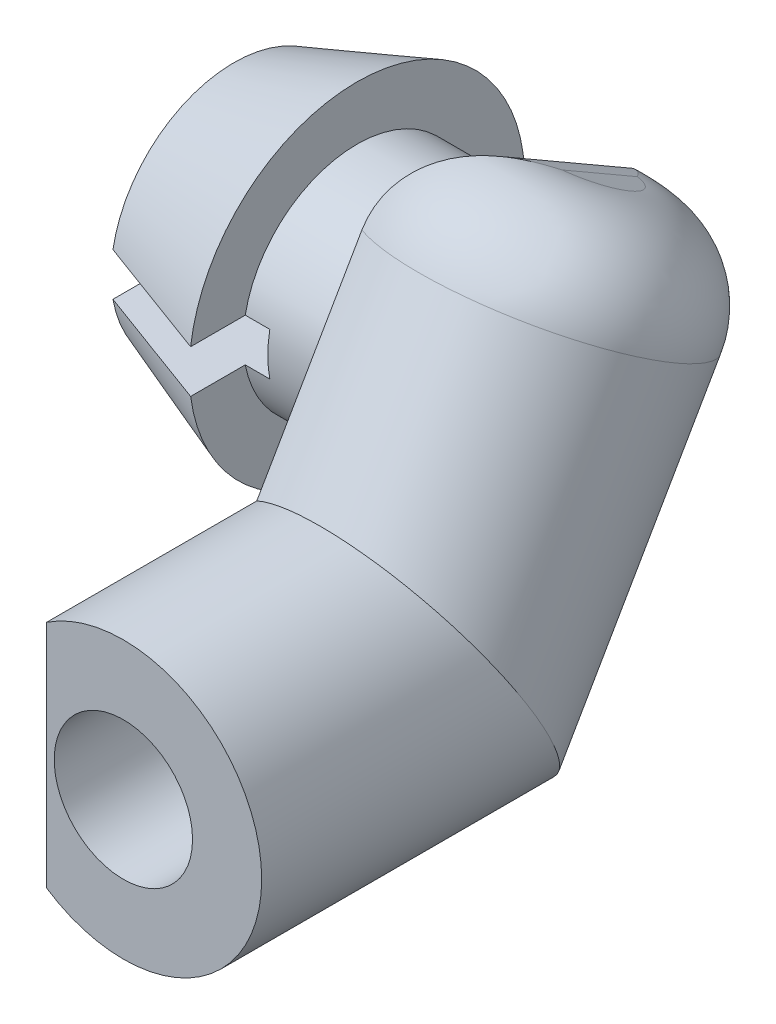
ISO-10303-21;
HEADER;
FILE_DESCRIPTION(('STEP AP214'),'2;1');
FILE_NAME('part.step','',(''),(''),'','','');
FILE_SCHEMA(('AUTOMOTIVE_DESIGN { 1 0 10303 214 1 1 1 1 }'));
ENDSEC;
DATA;
#1=APPLICATION_CONTEXT('core data for automotive mechanical design processes');
#2=APPLICATION_PROTOCOL_DEFINITION('international standard','automotive_design',2000,#1);
#3=PRODUCT_CONTEXT('',#1,'mechanical');
#4=PRODUCT('Part','Part','',(#3));
#5=PRODUCT_RELATED_PRODUCT_CATEGORY('part','',(#4));
#6=PRODUCT_DEFINITION_FORMATION('','',#4);
#7=PRODUCT_DEFINITION_CONTEXT('part definition',#1,'design');
#8=PRODUCT_DEFINITION('design','',#6,#7);
#9=PRODUCT_DEFINITION_SHAPE('','',#8);
#10=(LENGTH_UNIT() NAMED_UNIT(*) SI_UNIT(.MILLI.,.METRE.));
#11=(NAMED_UNIT(*) PLANE_ANGLE_UNIT() SI_UNIT($,.RADIAN.));
#12=(NAMED_UNIT(*) SI_UNIT($,.STERADIAN.) SOLID_ANGLE_UNIT());
#13=UNCERTAINTY_MEASURE_WITH_UNIT(LENGTH_MEASURE(1.E-05),#10,'distance_accuracy_value','');
#14=(GEOMETRIC_REPRESENTATION_CONTEXT(3) GLOBAL_UNCERTAINTY_ASSIGNED_CONTEXT((#13)) GLOBAL_UNIT_ASSIGNED_CONTEXT((#10,
#11,#12)) REPRESENTATION_CONTEXT('',''));
#15=CARTESIAN_POINT('',(0.,0.,0.));
#16=DIRECTION('',(0.,0.,1.));
#17=DIRECTION('',(1.,0.,0.));
#18=AXIS2_PLACEMENT_3D('',#15,#16,#17);
#19=CARTESIAN_POINT('',(-2.45,3.03150325993902,-6.24928233047493));
#20=DIRECTION('',(1.,0.,0.));
#21=DIRECTION('',(0.,0.,-1.));
#22=AXIS2_PLACEMENT_3D('',#19,#20,#21);
#23=CYLINDRICAL_SURFACE('',#22,1.85);
#24=CARTESIAN_POINT('',(-1.25,3.03150325993902,-6.24928233047493));
#25=DIRECTION('',(1.,0.,0.));
#26=DIRECTION('',(0.,0.,-1.));
#27=AXIS2_PLACEMENT_3D('',#24,#25,#26);
#28=CIRCLE('',#27,1.85);
#29=CARTESIAN_POINT('',(-1.25,3.1193095429098,-8.09719738714579));
#30=VERTEX_POINT('',#29);
#31=CARTESIAN_POINT('',(-1.25,4.67574778453712,-5.40136727380407));
#32=VERTEX_POINT('',#31);
#33=EDGE_CURVE('E178',#30,#32,#28,.F.);
#34=ORIENTED_EDGE('',*,*,#33,.T.);
#35=CARTESIAN_POINT('',(-1.25,4.67574778453712,-5.40136727380407));
#36=CARTESIAN_POINT('',(-1.25000121979341,4.69741105624072,-5.44336328630028));
#37=CARTESIAN_POINT('',(-1.24841961478353,4.71743096333026,-5.48614866521578));
#38=CARTESIAN_POINT('',(-1.24258977067846,4.75406605077159,-5.57290476960205));
#39=CARTESIAN_POINT('',(-1.23834561930391,4.77068639858206,-5.61687357933179));
#40=CARTESIAN_POINT('',(-1.22244273194947,4.81512468008795,-5.74945080757565));
#41=CARTESIAN_POINT('',(-1.20759742293953,4.83786936065223,-5.83941362848114));
#42=CARTESIAN_POINT('',(-1.17336029017098,4.86955794135819,-6.02024792146274));
#43=CARTESIAN_POINT('',(-1.15399301659849,4.87857445239295,-6.11111203611594));
#44=CARTESIAN_POINT('',(-1.11427709602543,4.88323244260568,-6.29324049690353));
#45=CARTESIAN_POINT('',(-1.09392549436535,4.87883083211679,-6.38450519064851));
#46=CARTESIAN_POINT('',(-1.05300766425374,4.85467067879845,-6.58060963875227));
#47=CARTESIAN_POINT('',(-1.03292448799233,4.83257571640876,-6.68529396859944));
#48=CARTESIAN_POINT('',(-1.00991330576057,4.78581326895761,-6.83899951034959));
#49=CARTESIAN_POINT('',(-1.00343104098379,4.76797701066329,-6.88963897413855));
#50=CARTESIAN_POINT('',(-0.993349655175071,4.72784366705155,-6.98942811725313));
#51=CARTESIAN_POINT('',(-0.9897498028627,4.7055477149728,-7.03857817140181));
#52=CARTESIAN_POINT('',(-0.98600016415372,4.65948869985272,-7.12930876643157));
#53=CARTESIAN_POINT('',(-0.985501666041698,4.63618811819955,-7.17111041400118));
#54=CARTESIAN_POINT('',(-0.987051878414754,4.58644119589734,-7.2527552107333));
#55=CARTESIAN_POINT('',(-0.989101454927161,4.55999378848356,-7.29259768923744));
#56=CARTESIAN_POINT('',(-0.998900113700351,4.47626778757583,-7.40869331291401));
#57=CARTESIAN_POINT('',(-1.01029801577574,4.41459014636724,-7.48154459982543));
#58=CARTESIAN_POINT('',(-1.03871039863275,4.28688056062028,-7.61096561180715));
#59=CARTESIAN_POINT('',(-1.05522477346423,4.22154968043957,-7.66835711703519));
#60=CARTESIAN_POINT('',(-1.09089104291814,4.08390354647642,-7.77323876354404));
#61=CARTESIAN_POINT('',(-1.1100465802427,4.01157868844169,-7.82071499821039));
#62=CARTESIAN_POINT('',(-1.15145751959943,3.84643662751125,-7.91331300289418));
#63=CARTESIAN_POINT('',(-1.17360251230077,3.75235010978907,-7.95623529209763));
#64=CARTESIAN_POINT('',(-1.21172750019582,3.55737384347678,-8.02596197640884));
#65=CARTESIAN_POINT('',(-1.22772940474008,3.45650980881703,-8.05282384587123));
#66=CARTESIAN_POINT('',(-1.24176803046921,3.31503848880074,-8.07784795722367));
#67=CARTESIAN_POINT('',(-1.24478270851941,3.27615582464556,-8.08345565350654));
#68=CARTESIAN_POINT('',(-1.24889945449133,3.19798315269313,-8.09219618368726));
#69=CARTESIAN_POINT('',(-1.24999996237084,3.15869283886994,-8.09532699780284));
#70=CARTESIAN_POINT('',(-1.25,3.1193095429098,-8.09719738714579));
#71=B_SPLINE_CURVE_WITH_KNOTS('',3,(#35,#36,#37,#38,#39,#40,#41,#42,#43,#44,#45,#46,#47,#48,#49,
#50,#51,#52,#53,#54,#55,#56,#57,#58,#59,#60,#61,#62,#63,#64,#65,#66,#67,#68,#69,#70),
.UNSPECIFIED.,.F.,.F.,(4,2,2,2,2,2,2,2,2,2,2,2,2,2,2,2,2,4),(0.,0.141616962720466,
0.283017035833864,0.563547721889874,0.842589409430656,1.12252812756175,1.44709634485264,
1.6091013976754,1.77106533608546,1.91443045887446,2.05784432123449,2.34457271448195,
2.60922102894377,2.87423806819121,3.19010308915769,3.50483087199597,3.62292517315778,
3.74111567575703),.UNSPECIFIED.);
#72=EDGE_CURVE('E11',#32,#30,#71,.T.);
#73=ORIENTED_EDGE('',*,*,#72,.T.);
#74=EDGE_LOOP('',(#34,#73));
#75=FACE_BOUND('',#74,.T.);
#76=DIRECTION('',(1.,0.,0.));
#77=VECTOR('',#76,1.);
#78=CARTESIAN_POINT('',(-2.45,2.68150325993902,-4.43269211801644));
#79=LINE('',#78,#77);
#80=CARTESIAN_POINT('',(-2.45,2.68150325993902,-4.43269211801644));
#81=VERTEX_POINT('',#80);
#82=CARTESIAN_POINT('',(-2.05,2.68150325993902,-4.43269211801644));
#83=VERTEX_POINT('',#82);
#84=EDGE_CURVE('E160',#81,#83,#79,.T.);
#85=ORIENTED_EDGE('',*,*,#84,.F.);
#86=CARTESIAN_POINT('',(-2.45,3.03150325993902,-6.24928233047493));
#87=DIRECTION('',(-1.,0.,0.));
#88=DIRECTION('',(0.,0.,1.));
#89=AXIS2_PLACEMENT_3D('',#86,#87,#88);
#90=CIRCLE('',#89,1.85);
#91=CARTESIAN_POINT('',(-2.45,3.38150325993902,-4.43269211801644));
#92=VERTEX_POINT('',#91);
#93=EDGE_CURVE('E165',#92,#81,#90,.T.);
#94=ORIENTED_EDGE('',*,*,#93,.F.);
#95=DIRECTION('',(1.,0.,0.));
#96=VECTOR('',#95,1.);
#97=CARTESIAN_POINT('',(-2.45,3.38150325993902,-4.43269211801644));
#98=LINE('',#97,#96);
#99=CARTESIAN_POINT('',(-2.05,3.38150325993902,-4.43269211801644));
#100=VERTEX_POINT('',#99);
#101=EDGE_CURVE('E308',#92,#100,#98,.T.);
#102=ORIENTED_EDGE('',*,*,#101,.T.);
#103=CARTESIAN_POINT('',(-2.05,3.03150325993902,-6.24928233047493));
#104=DIRECTION('',(-1.,0.,0.));
#105=DIRECTION('',(0.,0.,1.));
#106=AXIS2_PLACEMENT_3D('',#103,#104,#105);
#107=CIRCLE('',#106,1.85);
#108=EDGE_CURVE('E156',#83,#100,#107,.T.);
#109=ORIENTED_EDGE('',*,*,#108,.F.);
#110=EDGE_LOOP('',(#85,#94,#102,#109));
#111=FACE_BOUND('',#110,.T.);
#112=ADVANCED_FACE('F42',(#75,#111),#23,.T.);
#113=CARTESIAN_POINT('',(-4.45,3.03150325993902,-6.24928233047493));
#114=DIRECTION('',(1.,0.,0.));
#115=DIRECTION('',(0.,0.,1.));
#116=AXIS2_PLACEMENT_3D('',#113,#114,#115);
#117=CONICAL_SURFACE('',#116,2.,0.349065850398867);
#118=CARTESIAN_POINT('',(-7.24583087660519,2.68150325993902,-5.33134371909587));
#119=CARTESIAN_POINT('',(-7.13213382111476,2.68150325993902,-5.28707279867282));
#120=CARTESIAN_POINT('',(-7.01831275225143,2.68150325993902,-5.24312277983278));
#121=CARTESIAN_POINT('',(-6.79048592817877,2.68150325993902,-5.15570642590608));
#122=CARTESIAN_POINT('',(-6.67648017443273,2.68150325993902,-5.11224008700838));
#123=CARTESIAN_POINT('',(-6.33428168304235,2.68150325993902,-4.98232969868854));
#124=CARTESIAN_POINT('',(-6.10590424158329,2.68150325993902,-4.89637293623471));
#125=CARTESIAN_POINT('',(-5.64888458324298,2.68150325993902,-4.72518345294186));
#126=CARTESIAN_POINT('',(-5.42024237230883,2.68150325993902,-4.63995071618539));
#127=CARTESIAN_POINT('',(-4.96278965405802,2.68150325993902,-4.46993782990602));
#128=CARTESIAN_POINT('',(-4.73397914663228,2.68150325993902,-4.38515768067675));
#129=CARTESIAN_POINT('',(-4.04738516769673,2.68150325993902,-4.13125414104574));
#130=CARTESIAN_POINT('',(-3.58944011124171,2.68150325993902,-3.96256798358803));
#131=CARTESIAN_POINT('',(-2.67333013669729,2.68150325993902,-3.62576842690405));
#132=CARTESIAN_POINT('',(-2.21516521470735,2.68150325993902,-3.4576550383025));
#133=CARTESIAN_POINT('',(-1.29871133958246,2.68150325993902,-3.12176843409857));
#134=CARTESIAN_POINT('',(-0.840422386601865,2.68150325993902,-2.953995218075));
#135=CARTESIAN_POINT('',(-0.260778479802734,2.68150325993902,-2.74194782573838));
#136=CARTESIAN_POINT('',(-0.139459610081791,2.68150325993902,-2.69757495618113));
#137=CARTESIAN_POINT('',(0.103182379147166,2.68150325993902,-2.60884309322604));
#138=CARTESIAN_POINT('',(0.224505498625339,2.68150325993902,-2.5644840997466));
#139=CARTESIAN_POINT('',(0.345830876605189,2.68150325993902,-2.52013128072791));
#140=B_SPLINE_CURVE_WITH_KNOTS('',3,(#118,#119,#120,#121,#122,#123,#124,#125,#126,#127,#128,
#129,#130,#131,#132,#133,#134,#135,#136,#137,#138,#139),.UNSPECIFIED.,.F.,.F.,(4,2,2,2,2,2,2,2,
2,2,4),(0.,0.366034339768444,0.732065793405982,1.46411752990219,2.19615313063416,
2.9281892062517,4.39226414833949,5.85636610240713,7.32046624255301,7.70800330885212,
8.09553805177353),.UNSPECIFIED.);
#141=CARTESIAN_POINT('',(-4.45,2.68150325993902,-4.28014546372341));
#142=VERTEX_POINT('',#141);
#143=CARTESIAN_POINT('',(-2.45,2.68150325993902,-3.54388786758106));
#144=VERTEX_POINT('',#143);
#145=EDGE_CURVE('E276',#142,#144,#140,.T.);
#146=ORIENTED_EDGE('',*,*,#145,.F.);
#147=CARTESIAN_POINT('',(-4.45,3.03150325993902,-6.24928233047493));
#148=DIRECTION('',(-1.,0.,0.));
#149=DIRECTION('',(0.,0.,1.));
#150=AXIS2_PLACEMENT_3D('',#147,#148,#149);
#151=CIRCLE('',#150,2.);
#152=CARTESIAN_POINT('',(-4.45,3.38150325993902,-4.28014546372341));
#153=VERTEX_POINT('',#152);
#154=EDGE_CURVE('E163',#153,#142,#151,.T.);
#155=ORIENTED_EDGE('',*,*,#154,.F.);
#156=CARTESIAN_POINT('',(-7.24583087660519,3.38150325993902,-5.33134371909587));
#157=CARTESIAN_POINT('',(-7.13213382111476,3.38150325993902,-5.28707279867282));
#158=CARTESIAN_POINT('',(-7.01831275225143,3.38150325993902,-5.24312277983278));
#159=CARTESIAN_POINT('',(-6.79048592817877,3.38150325993902,-5.15570642590608));
#160=CARTESIAN_POINT('',(-6.67648017443273,3.38150325993902,-5.11224008700838));
#161=CARTESIAN_POINT('',(-6.33428168304235,3.38150325993902,-4.98232969868854));
#162=CARTESIAN_POINT('',(-6.10590424158329,3.38150325993902,-4.89637293623471));
#163=CARTESIAN_POINT('',(-5.64888458324298,3.38150325993902,-4.72518345294186));
#164=CARTESIAN_POINT('',(-5.42024237230883,3.38150325993902,-4.63995071618539));
#165=CARTESIAN_POINT('',(-4.96278965405802,3.38150325993902,-4.46993782990602));
#166=CARTESIAN_POINT('',(-4.73397914663228,3.38150325993902,-4.38515768067675));
#167=CARTESIAN_POINT('',(-4.04738516769673,3.38150325993902,-4.13125414104574));
#168=CARTESIAN_POINT('',(-3.58944011124171,3.38150325993902,-3.96256798358803));
#169=CARTESIAN_POINT('',(-2.67333013669729,3.38150325993902,-3.62576842690405));
#170=CARTESIAN_POINT('',(-2.21516521470735,3.38150325993902,-3.4576550383025));
#171=CARTESIAN_POINT('',(-1.29871133958246,3.38150325993902,-3.12176843409857));
#172=CARTESIAN_POINT('',(-0.840422386601865,3.38150325993902,-2.953995218075));
#173=CARTESIAN_POINT('',(-0.260778479802735,3.38150325993902,-2.74194782573838));
#174=CARTESIAN_POINT('',(-0.139459610081791,3.38150325993902,-2.69757495618113));
#175=CARTESIAN_POINT('',(0.103182379147165,3.38150325993902,-2.60884309322604));
#176=CARTESIAN_POINT('',(0.224505498625339,3.38150325993902,-2.5644840997466));
#177=CARTESIAN_POINT('',(0.345830876605189,3.38150325993902,-2.52013128072791));
#178=B_SPLINE_CURVE_WITH_KNOTS('',3,(#156,#157,#158,#159,#160,#161,#162,#163,#164,#165,#166,
#167,#168,#169,#170,#171,#172,#173,#174,#175,#176,#177),.UNSPECIFIED.,.F.,.F.,(4,2,2,2,2,2,2,2,
2,2,4),(0.,0.366034339768444,0.732065793405982,1.46411752990219,2.19615313063416,
2.9281892062517,4.39226414833949,5.85636610240713,7.32046624255301,7.70800330885212,
8.09553805177353),.UNSPECIFIED.);
#179=CARTESIAN_POINT('',(-2.45,3.38150325993902,-3.54388786758106));
#180=VERTEX_POINT('',#179);
#181=EDGE_CURVE('E137',#153,#180,#178,.T.);
#182=ORIENTED_EDGE('',*,*,#181,.T.);
#183=CARTESIAN_POINT('',(-2.45,3.03150325993902,-6.24928233047493));
#184=DIRECTION('',(-1.,0.,0.));
#185=DIRECTION('',(0.,0.,1.));
#186=AXIS2_PLACEMENT_3D('',#183,#184,#185);
#187=CIRCLE('',#186,2.72794046853241);
#188=EDGE_CURVE('E158',#180,#144,#187,.T.);
#189=ORIENTED_EDGE('',*,*,#188,.T.);
#190=EDGE_LOOP('',(#146,#155,#182,#189));
#191=FACE_BOUND('',#190,.T.);
#192=ADVANCED_FACE('F225',(#191),#117,.T.);
#193=CARTESIAN_POINT('',(-4.45,3.03150325993902,-6.24928233047493));
#194=DIRECTION('',(-1.,0.,0.));
#195=DIRECTION('',(0.,0.,1.));
#196=AXIS2_PLACEMENT_3D('',#193,#194,#195);
#197=PLANE('',#196);
#198=ORIENTED_EDGE('',*,*,#154,.T.);
#199=DIRECTION('',(0.,0.,1.));
#200=VECTOR('',#199,1.);
#201=CARTESIAN_POINT('',(-4.45,2.68150325993902,-5.47468566123345));
#202=LINE('',#201,#200);
#203=CARTESIAN_POINT('',(-4.45,2.68150325993902,-5.47468566123345));
#204=VERTEX_POINT('',#203);
#205=EDGE_CURVE('E142',#204,#142,#202,.T.);
#206=ORIENTED_EDGE('',*,*,#205,.F.);
#207=CARTESIAN_POINT('',(-4.45,3.03150325993902,-6.24928233047493));
#208=DIRECTION('',(-1.,0.,0.));
#209=DIRECTION('',(0.,0.,1.));
#210=AXIS2_PLACEMENT_3D('',#207,#208,#209);
#211=CIRCLE('',#210,0.85);
#212=CARTESIAN_POINT('',(-4.45,3.38150325993902,-5.47468566123345));
#213=VERTEX_POINT('',#212);
#214=EDGE_CURVE('E149',#213,#204,#211,.T.);
#215=ORIENTED_EDGE('',*,*,#214,.F.);
#216=DIRECTION('',(0.,0.,1.));
#217=VECTOR('',#216,1.);
#218=CARTESIAN_POINT('',(-4.45,3.38150325993902,-5.47468566123345));
#219=LINE('',#218,#217);
#220=EDGE_CURVE('E130',#213,#153,#219,.T.);
#221=ORIENTED_EDGE('',*,*,#220,.T.);
#222=EDGE_LOOP('',(#198,#206,#215,#221));
#223=FACE_BOUND('',#222,.T.);
#224=ADVANCED_FACE('F155',(#223),#197,.T.);
#225=CARTESIAN_POINT('',(-2.45,3.03150325993902,-6.24928233047493));
#226=DIRECTION('',(-1.,0.,0.));
#227=DIRECTION('',(0.,0.,1.));
#228=AXIS2_PLACEMENT_3D('',#225,#226,#227);
#229=PLANE('',#228);
#230=DIRECTION('',(0.,0.,-1.));
#231=VECTOR('',#230,1.);
#232=CARTESIAN_POINT('',(-2.45,2.68150325993902,-6.24928233047493));
#233=LINE('',#232,#231);
#234=EDGE_CURVE('E284',#144,#81,#233,.T.);
#235=ORIENTED_EDGE('',*,*,#234,.F.);
#236=ORIENTED_EDGE('',*,*,#188,.F.);
#237=DIRECTION('',(0.,0.,-1.));
#238=VECTOR('',#237,1.);
#239=CARTESIAN_POINT('',(-2.45,3.38150325993902,-6.24928233047493));
#240=LINE('',#239,#238);
#241=EDGE_CURVE('E152',#180,#92,#240,.T.);
#242=ORIENTED_EDGE('',*,*,#241,.T.);
#243=ORIENTED_EDGE('',*,*,#93,.T.);
#244=EDGE_LOOP('',(#235,#236,#242,#243));
#245=FACE_BOUND('',#244,.T.);
#246=ADVANCED_FACE('F227',(#245),#229,.F.);
#247=CARTESIAN_POINT('',(-2.05,3.03150325993902,-6.24928233047493));
#248=DIRECTION('',(-1.,0.,0.));
#249=DIRECTION('',(0.,0.,1.));
#250=AXIS2_PLACEMENT_3D('',#247,#248,#249);
#251=CYLINDRICAL_SURFACE('',#250,0.85);
#252=DIRECTION('',(-1.,0.,0.));
#253=VECTOR('',#252,1.);
#254=CARTESIAN_POINT('',(-2.05,2.68150325993902,-5.47468566123345));
#255=LINE('',#254,#253);
#256=CARTESIAN_POINT('',(-2.05,2.68150325993902,-5.47468566123345));
#257=VERTEX_POINT('',#256);
#258=EDGE_CURVE('E316',#257,#204,#255,.T.);
#259=ORIENTED_EDGE('',*,*,#258,.F.);
#260=CARTESIAN_POINT('',(-2.05,3.03150325993902,-6.24928233047493));
#261=DIRECTION('',(-1.,0.,0.));
#262=DIRECTION('',(0.,0.,1.));
#263=AXIS2_PLACEMENT_3D('',#260,#261,#262);
#264=CIRCLE('',#263,0.85);
#265=CARTESIAN_POINT('',(-2.05,3.38150325993902,-5.47468566123345));
#266=VERTEX_POINT('',#265);
#267=EDGE_CURVE('E151',#266,#257,#264,.T.);
#268=ORIENTED_EDGE('',*,*,#267,.F.);
#269=DIRECTION('',(-1.,0.,0.));
#270=VECTOR('',#269,1.);
#271=CARTESIAN_POINT('',(-2.05,3.38150325993902,-5.47468566123345));
#272=LINE('',#271,#270);
#273=EDGE_CURVE('E134',#266,#213,#272,.T.);
#274=ORIENTED_EDGE('',*,*,#273,.T.);
#275=ORIENTED_EDGE('',*,*,#214,.T.);
#276=EDGE_LOOP('',(#259,#268,#274,#275));
#277=FACE_BOUND('',#276,.T.);
#278=ADVANCED_FACE('F148',(#277),#251,.F.);
#279=CARTESIAN_POINT('',(0.,5.19615242270664,-7.49999999999999));
#280=DIRECTION('',(0.,-0.86602540378444,0.499999999999998));
#281=DIRECTION('',(1.,0.,0.));
#282=AXIS2_PLACEMENT_3D('',#279,#280,#281);
#283=PLANE('',#282);
#284=CARTESIAN_POINT('',(0.,5.19615242270664,-7.49999999999998));
#285=DIRECTION('',(0.,-0.86602540378444,0.499999999999998));
#286=DIRECTION('',(0.,-0.499999999999998,-0.86602540378444));
#287=AXIS2_PLACEMENT_3D('',#284,#285,#286);
#288=CIRCLE('',#287,0.75);
#289=CARTESIAN_POINT('',(0.25,5.54970581329991,-6.88762756430419));
#290=VERTEX_POINT('',#289);
#291=CARTESIAN_POINT('',(0.25,4.84259903211337,-8.11237243569578));
#292=VERTEX_POINT('',#291);
#293=EDGE_CURVE('E63',#290,#292,#288,.F.);
#294=ORIENTED_EDGE('',*,*,#293,.T.);
#295=DIRECTION('',(0.,-0.499999999999998,-0.86602540378444));
#296=VECTOR('',#295,1.);
#297=CARTESIAN_POINT('',(0.25,5.19615242270664,-7.49999999999999));
#298=LINE('',#297,#296);
#299=EDGE_CURVE('E209',#292,#290,#298,.F.);
#300=ORIENTED_EDGE('',*,*,#299,.T.);
#301=EDGE_LOOP('',(#294,#300));
#302=FACE_BOUND('',#301,.T.);
#303=ADVANCED_FACE('F239',(#302),#283,.F.);
#304=CARTESIAN_POINT('',(0.,0.,0.));
#305=DIRECTION('',(0.,0.,1.));
#306=DIRECTION('',(1.,0.,0.));
#307=AXIS2_PLACEMENT_3D('',#304,#305,#306);
#308=PLANE('',#307);
#309=CARTESIAN_POINT('',(0.,0.,0.));
#310=DIRECTION('',(0.,0.,1.));
#311=DIRECTION('',(1.,0.,0.));
#312=AXIS2_PLACEMENT_3D('',#309,#310,#311);
#313=CIRCLE('',#312,1.125);
#314=CARTESIAN_POINT('',(1.125,0.,0.));
#315=VERTEX_POINT('',#314);
#316=EDGE_CURVE('E168',#315,#315,#313,.T.);
#317=ORIENTED_EDGE('',*,*,#316,.F.);
#318=EDGE_LOOP('',(#317));
#319=FACE_BOUND('',#318,.T.);
#320=CARTESIAN_POINT('',(0.,0.,0.));
#321=DIRECTION('',(0.,0.,1.));
#322=DIRECTION('',(1.,0.,0.));
#323=AXIS2_PLACEMENT_3D('',#320,#321,#322);
#324=CIRCLE('',#323,2.25);
#325=CARTESIAN_POINT('',(-1.25,-1.87082869338697,0.));
#326=VERTEX_POINT('',#325);
#327=CARTESIAN_POINT('',(-1.25,1.87082869338697,0.));
#328=VERTEX_POINT('',#327);
#329=EDGE_CURVE('E180',#326,#328,#324,.T.);
#330=ORIENTED_EDGE('',*,*,#329,.T.);
#331=DIRECTION('',(0.,-1.,0.));
#332=VECTOR('',#331,1.);
#333=CARTESIAN_POINT('',(-1.25,1.87082869338697,0.));
#334=LINE('',#333,#332);
#335=EDGE_CURVE('E183',#328,#326,#334,.T.);
#336=ORIENTED_EDGE('',*,*,#335,.T.);
#337=EDGE_LOOP('',(#330,#336));
#338=FACE_BOUND('',#337,.T.);
#339=ADVANCED_FACE('F251',(#319,#338),#308,.T.);
#340=CARTESIAN_POINT('',(0.,-1.73972466625438,-3.49556949562221));
#341=DIRECTION('',(0.,0.86602540378444,-0.499999999999998));
#342=DIRECTION('',(0.,0.499999999999998,0.86602540378444));
#343=AXIS2_PLACEMENT_3D('',#340,#341,#342);
#344=CYLINDRICAL_SURFACE('',#343,2.25);
#345=DIRECTION('',(0.,0.86602540378444,-0.499999999999998));
#346=VECTOR('',#345,1.);
#347=CARTESIAN_POINT('',(-1.25,-2.67513901294786,-5.11575467022417));
#348=LINE('',#347,#346);
#349=CARTESIAN_POINT('',(-1.25,-1.87082869338697,-5.58012344973465));
#350=VERTEX_POINT('',#349);
#351=CARTESIAN_POINT('',(-1.25,2.9616999703365,-8.37018517460196));
#352=VERTEX_POINT('',#351);
#353=EDGE_CURVE('E184',#350,#352,#348,.T.);
#354=ORIENTED_EDGE('',*,*,#353,.T.);
#355=CARTESIAN_POINT('',(0.,3.89711431702998,-6.74999999999999));
#356=DIRECTION('',(0.,-0.86602540378444,0.499999999999998));
#357=DIRECTION('',(0.,-0.499999999999998,-0.86602540378444));
#358=AXIS2_PLACEMENT_3D('',#355,#356,#357);
#359=CIRCLE('',#358,2.25);
#360=CARTESIAN_POINT('',(-1.25,4.83252866372346,-5.12981482539802));
#361=VERTEX_POINT('',#360);
#362=EDGE_CURVE('E56',#352,#361,#359,.T.);
#363=ORIENTED_EDGE('',*,*,#362,.T.);
#364=DIRECTION('',(0.,0.86602540378444,-0.499999999999998));
#365=VECTOR('',#364,1.);
#366=CARTESIAN_POINT('',(-1.25,-0.804310319560902,-1.87538432102024));
#367=LINE('',#366,#365);
#368=CARTESIAN_POINT('',(-1.25,1.87082869338697,-3.41987655026535));
#369=VERTEX_POINT('',#368);
#370=EDGE_CURVE('E172',#369,#361,#367,.T.);
#371=ORIENTED_EDGE('',*,*,#370,.F.);
#372=CARTESIAN_POINT('',(0.,0.,-4.5));
#373=DIRECTION('',(0.,0.500000000000001,-0.866025403784438));
#374=DIRECTION('',(0.,-0.866025403784438,-0.500000000000001));
#375=AXIS2_PLACEMENT_3D('',#372,#373,#374);
#376=ELLIPSE('',#375,2.59807621135332,2.25);
#377=EDGE_CURVE('E179',#369,#350,#376,.T.);
#378=ORIENTED_EDGE('',*,*,#377,.T.);
#379=EDGE_LOOP('',(#354,#363,#371,#378));
#380=FACE_BOUND('',#379,.T.);
#381=ADVANCED_FACE('F248',(#380),#344,.T.);
#382=CARTESIAN_POINT('',(-1.25,-0.804310319560902,-1.87538432102024));
#383=DIRECTION('',(1.,0.,0.));
#384=DIRECTION('',(0.,0.,-1.));
#385=AXIS2_PLACEMENT_3D('',#382,#383,#384);
#386=PLANE('',#385);
#387=ORIENTED_EDGE('',*,*,#370,.T.);
#388=DIRECTION('',(0.,-0.499999999999998,-0.86602540378444));
#389=VECTOR('',#388,1.);
#390=CARTESIAN_POINT('',(-1.25,4.83252866372346,-5.12981482539802));
#391=LINE('',#390,#389);
#392=EDGE_CURVE('E205',#361,#32,#391,.T.);
#393=ORIENTED_EDGE('',*,*,#392,.T.);
#394=ORIENTED_EDGE('',*,*,#33,.F.);
#395=DIRECTION('',(0.,-0.499999999999998,-0.86602540378444));
#396=VECTOR('',#395,1.);
#397=CARTESIAN_POINT('',(-1.25,4.83252866372346,-5.12981482539802));
#398=LINE('',#397,#396);
#399=EDGE_CURVE('E201',#30,#352,#398,.T.);
#400=ORIENTED_EDGE('',*,*,#399,.T.);
#401=ORIENTED_EDGE('',*,*,#353,.F.);
#402=DIRECTION('',(0.,0.866025403784438,0.500000000000001));
#403=VECTOR('',#402,1.);
#404=CARTESIAN_POINT('',(-1.25,3.35167867855522,-2.56490741269901));
#405=LINE('',#404,#403);
#406=EDGE_CURVE('E175',#350,#369,#405,.T.);
#407=ORIENTED_EDGE('',*,*,#406,.T.);
#408=EDGE_LOOP('',(#387,#393,#394,#400,#401,#407));
#409=FACE_BOUND('',#408,.T.);
#410=ADVANCED_FACE('F246',(#409),#386,.F.);
#411=CARTESIAN_POINT('',(-1.25,1.87082869338697,0.));
#412=DIRECTION('',(1.,0.,0.));
#413=DIRECTION('',(0.,1.,0.));
#414=AXIS2_PLACEMENT_3D('',#411,#412,#413);
#415=PLANE('',#414);
#416=DIRECTION('',(0.,0.,-1.));
#417=VECTOR('',#416,1.);
#418=CARTESIAN_POINT('',(-1.25,-1.87082869338697,0.));
#419=LINE('',#418,#417);
#420=EDGE_CURVE('E188',#326,#350,#419,.T.);
#421=ORIENTED_EDGE('',*,*,#420,.F.);
#422=ORIENTED_EDGE('',*,*,#335,.F.);
#423=DIRECTION('',(0.,0.,-1.));
#424=VECTOR('',#423,1.);
#425=CARTESIAN_POINT('',(-1.25,1.87082869338697,0.));
#426=LINE('',#425,#424);
#427=EDGE_CURVE('E185',#328,#369,#426,.T.);
#428=ORIENTED_EDGE('',*,*,#427,.T.);
#429=ORIENTED_EDGE('',*,*,#406,.F.);
#430=EDGE_LOOP('',(#421,#422,#428,#429));
#431=FACE_BOUND('',#430,.T.);
#432=ADVANCED_FACE('F242',(#431),#415,.F.);
#433=CARTESIAN_POINT('',(0.,0.,0.));
#434=DIRECTION('',(0.,0.,-1.));
#435=DIRECTION('',(-1.,0.,0.));
#436=AXIS2_PLACEMENT_3D('',#433,#434,#435);
#437=CYLINDRICAL_SURFACE('',#436,2.25);
#438=ORIENTED_EDGE('',*,*,#427,.F.);
#439=ORIENTED_EDGE('',*,*,#329,.F.);
#440=ORIENTED_EDGE('',*,*,#420,.T.);
#441=ORIENTED_EDGE('',*,*,#377,.F.);
#442=EDGE_LOOP('',(#438,#439,#440,#441));
#443=FACE_BOUND('',#442,.T.);
#444=ADVANCED_FACE('F237',(#443),#437,.T.);
#445=CARTESIAN_POINT('',(0.,0.,-4.5));
#446=DIRECTION('',(0.,0.,1.));
#447=DIRECTION('',(1.,0.,0.));
#448=AXIS2_PLACEMENT_3D('',#445,#446,#447);
#449=CYLINDRICAL_SURFACE('',#448,1.125);
#450=CARTESIAN_POINT('',(0.,0.,-4.5));
#451=DIRECTION('',(0.,0.,1.));
#452=DIRECTION('',(1.,0.,0.));
#453=AXIS2_PLACEMENT_3D('',#450,#451,#452);
#454=CIRCLE('',#453,1.125);
#455=CARTESIAN_POINT('',(1.125,0.,-4.5));
#456=VERTEX_POINT('',#455);
#457=EDGE_CURVE('E169',#456,#456,#454,.T.);
#458=ORIENTED_EDGE('',*,*,#457,.F.);
#459=EDGE_LOOP('',(#458));
#460=FACE_BOUND('',#459,.T.);
#461=ORIENTED_EDGE('',*,*,#316,.T.);
#462=EDGE_LOOP('',(#461));
#463=FACE_BOUND('',#462,.T.);
#464=ADVANCED_FACE('F233',(#460,#463),#449,.F.);
#465=CARTESIAN_POINT('',(0.,0.,-4.5));
#466=DIRECTION('',(0.,0.,1.));
#467=DIRECTION('',(1.,0.,0.));
#468=AXIS2_PLACEMENT_3D('',#465,#466,#467);
#469=PLANE('',#468);
#470=ORIENTED_EDGE('',*,*,#457,.T.);
#471=EDGE_LOOP('',(#470));
#472=FACE_BOUND('',#471,.T.);
#473=ADVANCED_FACE('F229',(#472),#469,.T.);
#474=CARTESIAN_POINT('',(-2.05,3.03150325993902,-6.24928233047493));
#475=DIRECTION('',(-1.,0.,0.));
#476=DIRECTION('',(0.,0.,1.));
#477=AXIS2_PLACEMENT_3D('',#474,#475,#476);
#478=PLANE('',#477);
#479=ORIENTED_EDGE('',*,*,#267,.T.);
#480=DIRECTION('',(0.,0.,1.));
#481=VECTOR('',#480,1.);
#482=CARTESIAN_POINT('',(-2.05,2.68150325993902,-5.47468566123345));
#483=LINE('',#482,#481);
#484=EDGE_CURVE('E313',#257,#83,#483,.T.);
#485=ORIENTED_EDGE('',*,*,#484,.T.);
#486=ORIENTED_EDGE('',*,*,#108,.T.);
#487=DIRECTION('',(0.,0.,1.));
#488=VECTOR('',#487,1.);
#489=CARTESIAN_POINT('',(-2.05,3.38150325993902,-5.47468566123345));
#490=LINE('',#489,#488);
#491=EDGE_CURVE('E312',#266,#100,#490,.T.);
#492=ORIENTED_EDGE('',*,*,#491,.F.);
#493=EDGE_LOOP('',(#479,#485,#486,#492));
#494=FACE_BOUND('',#493,.T.);
#495=ADVANCED_FACE('F232',(#494),#478,.T.);
#496=CARTESIAN_POINT('',(-2.05,2.68150325993902,-5.47468566123345));
#497=DIRECTION('',(0.,1.,0.));
#498=DIRECTION('',(-1.,0.,0.));
#499=AXIS2_PLACEMENT_3D('',#496,#497,#498);
#500=PLANE('',#499);
#501=ORIENTED_EDGE('',*,*,#84,.T.);
#502=ORIENTED_EDGE('',*,*,#484,.F.);
#503=ORIENTED_EDGE('',*,*,#258,.T.);
#504=ORIENTED_EDGE('',*,*,#205,.T.);
#505=ORIENTED_EDGE('',*,*,#145,.T.);
#506=ORIENTED_EDGE('',*,*,#234,.T.);
#507=EDGE_LOOP('',(#501,#502,#503,#504,#505,#506));
#508=FACE_BOUND('',#507,.T.);
#509=ADVANCED_FACE('F285',(#508),#500,.T.);
#510=CARTESIAN_POINT('',(-2.05,3.38150325993902,-5.47468566123345));
#511=DIRECTION('',(0.,1.,0.));
#512=DIRECTION('',(-1.,0.,0.));
#513=AXIS2_PLACEMENT_3D('',#510,#511,#512);
#514=PLANE('',#513);
#515=ORIENTED_EDGE('',*,*,#241,.F.);
#516=ORIENTED_EDGE('',*,*,#181,.F.);
#517=ORIENTED_EDGE('',*,*,#220,.F.);
#518=ORIENTED_EDGE('',*,*,#273,.F.);
#519=ORIENTED_EDGE('',*,*,#491,.T.);
#520=ORIENTED_EDGE('',*,*,#101,.F.);
#521=EDGE_LOOP('',(#515,#516,#517,#518,#519,#520));
#522=FACE_BOUND('',#521,.T.);
#523=ADVANCED_FACE('F132',(#522),#514,.F.);
#524=CARTESIAN_POINT('',(0.,3.89711431702998,-6.74999999999999));
#525=DIRECTION('',(0.,-0.86602540378444,0.499999999999998));
#526=DIRECTION('',(0.,-0.499999999999998,-0.86602540378444));
#527=AXIS2_PLACEMENT_3D('',#524,#525,#526);
#528=DEGENERATE_TOROIDAL_SURFACE('',#527,0.75,1.5,.T.);
#529=CARTESIAN_POINT('',(-1.25,2.9616999703365,-8.37018517460196));
#530=CARTESIAN_POINT('',(-1.25000185479303,2.99479987181354,-8.38929473665628));
#531=CARTESIAN_POINT('',(-1.24853809279602,3.02827310512129,-8.40771909432136));
#532=CARTESIAN_POINT('',(-1.24271278594958,3.0957432628677,-8.44307374989157));
#533=CARTESIAN_POINT('',(-1.23835185493461,3.1297400748836,-8.46000436342148));
#534=CARTESIAN_POINT('',(-1.22101743592931,3.23193810336593,-8.50825691182084));
#535=CARTESIAN_POINT('',(-1.20379173667515,3.30060683069265,-8.53718948360162));
#536=CARTESIAN_POINT('',(-1.15881907855963,3.437114660384,-8.5876822704788));
#537=CARTESIAN_POINT('',(-1.13107520035981,3.50495399966777,-8.60924464071501));
#538=CARTESIAN_POINT('',(-1.06632808373224,3.63825290162302,-8.64439350943133));
#539=CARTESIAN_POINT('',(-1.02932124805396,3.70371152841237,-8.65797690241725));
#540=CARTESIAN_POINT('',(-0.946317688210515,3.83296422819546,-8.67705115237366));
#541=CARTESIAN_POINT('',(-0.900069594258944,3.89663659593369,-8.68226698534826));
#542=CARTESIAN_POINT('',(-0.801343058142083,4.01902622294202,-8.68356884724809));
#543=CARTESIAN_POINT('',(-0.748863007282815,4.07774219606577,-8.67965251394676));
#544=CARTESIAN_POINT('',(-0.634585325110877,4.1948943701548,-8.66190901299882));
#545=CARTESIAN_POINT('',(-0.572375272555632,4.25279158575028,-8.64718981376087));
#546=CARTESIAN_POINT('',(-0.445543018425538,4.36187176134177,-8.6070723139378));
#547=CARTESIAN_POINT('',(-0.380918963935052,4.41304942169047,-8.58166564985287));
#548=CARTESIAN_POINT('',(-0.243615062410324,4.51525937312725,-8.51660363132629));
#549=CARTESIAN_POINT('',(-0.170964010711624,4.56543278971349,-8.47553967205533));
#550=CARTESIAN_POINT('',(-0.0298225192130016,4.65918926734154,-8.38094941831454));
#551=CARTESIAN_POINT('',(0.0386724069639423,4.70277951319638,-8.32743687460752));
#552=CARTESIAN_POINT('',(0.153444321716964,4.77697723425231,-8.22152697176421));
#553=CARTESIAN_POINT('',(0.201317225495194,4.80834933404336,-8.17140752768746));
#554=CARTESIAN_POINT('',(0.24692478173089,4.84042751800423,-8.1161289461768));
#555=CARTESIAN_POINT('',(0.248464759538978,4.84151349086552,-8.11425270366041));
#556=CARTESIAN_POINT('',(0.25,4.84259903211337,-8.11237243569578));
#557=B_SPLINE_CURVE_WITH_KNOTS('',3,(#529,#530,#531,#532,#533,#534,#535,#536,#537,#538,#539,
#540,#541,#542,#543,#544,#545,#546,#547,#548,#549,#550,#551,#552,#553,#554,#555,#556),
.UNSPECIFIED.,.F.,.F.,(4,2,2,2,2,2,2,2,2,2,2,2,2,4),(0.,0.114586572621303,0.229148875079893,
0.457385298715111,0.685554925934991,0.913813300213429,1.1494307707241,1.38510919540159,
1.64281343984214,1.90071972759309,2.19167251062203,2.48230541927415,2.70987022510457,
2.71784769081052),.UNSPECIFIED.);
#558=EDGE_CURVE('E216',#292,#352,#557,.F.);
#559=ORIENTED_EDGE('',*,*,#558,.F.);
#560=ORIENTED_EDGE('',*,*,#293,.F.);
#561=CARTESIAN_POINT('',(-1.25,4.83252866372346,-5.12981482539802));
#562=CARTESIAN_POINT('',(-1.25000185479303,4.86562798065622,-5.14892539991274));
#563=CARTESIAN_POINT('',(-1.24853809279602,4.89832055909647,-5.16870189147151));
#564=CARTESIAN_POINT('',(-1.24271278594958,4.96267366783553,-5.20945543429215));
#565=CARTESIAN_POINT('',(-1.23835185493461,4.99433441526204,-5.23043223038064));
#566=CARTESIAN_POINT('',(-1.22101743592931,5.08722136221438,-5.29481204506335));
#567=CARTESIAN_POINT('',(-1.20379173667515,5.14661206803671,-5.33981462148344));
#568=CARTESIAN_POINT('',(-1.15881907855963,5.2585940190259,-5.43278747637304));
#569=CARTESIAN_POINT('',(-1.13107520035981,5.31118724905815,-5.48075688245063));
#570=CARTESIAN_POINT('',(-1.06632808373224,5.4082765132584,-5.57862268348228));
#571=CARTESIAN_POINT('',(-1.02932124805396,5.45276939004846,-5.62851982068575));
#572=CARTESIAN_POINT('',(-0.946317688210514,5.53391452496038,-5.73091881722742));
#573=CARTESIAN_POINT('',(-0.900069594258942,5.57026775268741,-5.78345278872054));
#574=CARTESIAN_POINT('',(-0.801343058142081,5.63259001166905,-5.88879438391953));
#575=CARTESIAN_POINT('',(-0.748863007282812,5.65855635410228,-5.94160207490329));
#576=CARTESIAN_POINT('',(-0.634585325110876,5.70176611857381,-6.05193058424694));
#577=CARTESIAN_POINT('',(-0.572375272555632,5.71796752590812,-6.10943064337999));
#578=CARTESIAN_POINT('',(-0.445543018425536,5.73776483972077,-6.22395559640301));
#579=CARTESIAN_POINT('',(-0.380918963935048,5.74135085337215,-6.2809800824137));
#580=CARTESIAN_POINT('',(-0.243615062410321,5.73611046822503,-6.40202750614083));
#581=CARTESIAN_POINT('',(-0.170964010711626,5.72563474460952,-6.46601093913466));
#582=CARTESIAN_POINT('',(-0.0298225192129822,5.69059542073362,-6.59450155740028));
#583=CARTESIAN_POINT('',(0.0386724069639886,5.66604732138965,-6.65900808952127));
#584=CARTESIAN_POINT('',(0.153444321716932,5.61142551554293,-6.77622015228031));
#585=CARTESIAN_POINT('',(0.201317225495085,5.58370685364441,-6.82844890970785));
#586=CARTESIAN_POINT('',(0.246924781730884,5.55187328975148,-6.88386872268049));
#587=CARTESIAN_POINT('',(0.248464759538975,5.55079140249928,-6.88574732402439));
#588=CARTESIAN_POINT('',(0.25,5.54970581329991,-6.88762756430419));
#589=B_SPLINE_CURVE_WITH_KNOTS('',3,(#561,#562,#563,#564,#565,#566,#567,#568,#569,#570,#571,
#572,#573,#574,#575,#576,#577,#578,#579,#580,#581,#582,#583,#584,#585,#586,#587,#588),
.UNSPECIFIED.,.F.,.F.,(4,2,2,2,2,2,2,2,2,2,2,2,2,4),(0.,0.114586572621304,0.229148875079894,
0.457385298715111,0.685554925934991,0.913813300213429,1.14943077072411,1.38510919540159,
1.64281343984214,1.90071972759309,2.19167251062205,2.48230541927415,2.70987022510457,
2.71784769081052),.UNSPECIFIED.);
#590=EDGE_CURVE('E47',#361,#290,#589,.T.);
#591=ORIENTED_EDGE('',*,*,#590,.F.);
#592=ORIENTED_EDGE('',*,*,#362,.F.);
#593=EDGE_LOOP('',(#559,#560,#591,#592));
#594=FACE_BOUND('',#593,.T.);
#595=ADVANCED_FACE('F264',(#594),#528,.T.);
#596=CARTESIAN_POINT('',(0.25,4.83252866372346,-5.12981482539802));
#597=DIRECTION('',(0.,-0.499999999999998,-0.86602540378444));
#598=DIRECTION('',(0.,0.86602540378444,-0.499999999999998));
#599=AXIS2_PLACEMENT_3D('',#596,#597,#598);
#600=CYLINDRICAL_SURFACE('',#599,1.5);
#601=ORIENTED_EDGE('',*,*,#590,.T.);
#602=ORIENTED_EDGE('',*,*,#299,.F.);
#603=ORIENTED_EDGE('',*,*,#558,.T.);
#604=ORIENTED_EDGE('',*,*,#399,.F.);
#605=ORIENTED_EDGE('',*,*,#72,.F.);
#606=ORIENTED_EDGE('',*,*,#392,.F.);
#607=EDGE_LOOP('',(#601,#602,#603,#604,#605,#606));
#608=FACE_BOUND('',#607,.T.);
#609=ADVANCED_FACE('F44',(#608),#600,.T.);
#610=CLOSED_SHELL('',(#112,#192,#224,#246,#278,#303,#339,#381,#410,#432,#444,#464,#473,#495,
#509,#523,#595,#609));
#611=MANIFOLD_SOLID_BREP('B2',#610);
#612=ADVANCED_BREP_SHAPE_REPRESENTATION('',(#18,#611),#14);
#613=SHAPE_DEFINITION_REPRESENTATION(#9,#612);
ENDSEC;
END-ISO-10303-21;
